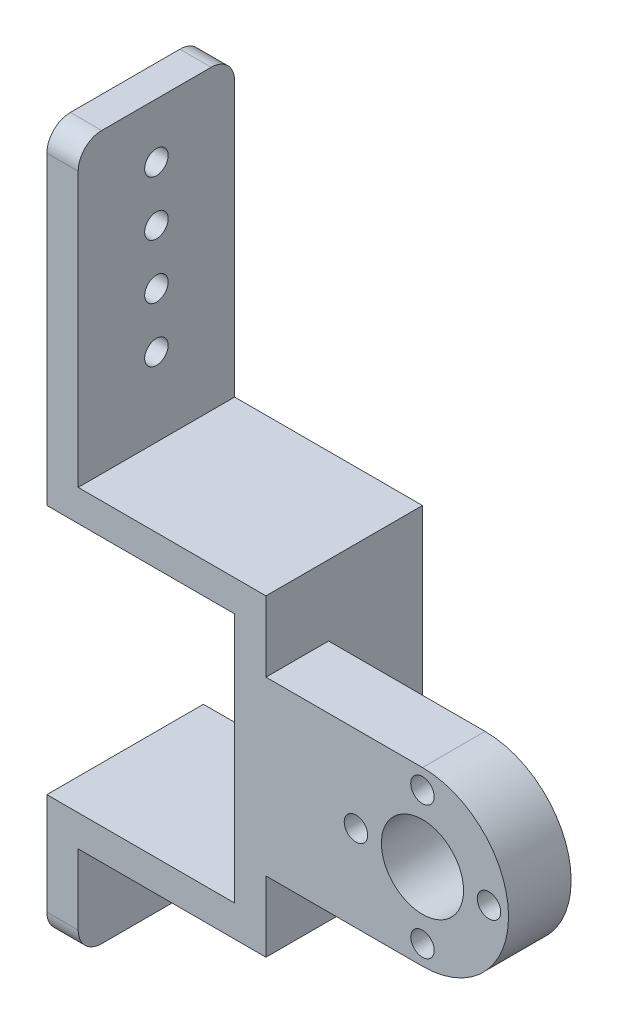
ISO-10303-21;
HEADER;
FILE_DESCRIPTION(('STEP AP214'),'2;1');
FILE_NAME('part.step','',(''),(''),'','','');
FILE_SCHEMA(('AUTOMOTIVE_DESIGN { 1 0 10303 214 1 1 1 1 }'));
ENDSEC;
DATA;
#1=APPLICATION_CONTEXT('core data for automotive mechanical design processes');
#2=APPLICATION_PROTOCOL_DEFINITION('international standard','automotive_design',2000,#1);
#3=PRODUCT_CONTEXT('',#1,'mechanical');
#4=PRODUCT('Part','Part','',(#3));
#5=PRODUCT_RELATED_PRODUCT_CATEGORY('part','',(#4));
#6=PRODUCT_DEFINITION_FORMATION('','',#4);
#7=PRODUCT_DEFINITION_CONTEXT('part definition',#1,'design');
#8=PRODUCT_DEFINITION('design','',#6,#7);
#9=PRODUCT_DEFINITION_SHAPE('','',#8);
#10=(LENGTH_UNIT() NAMED_UNIT(*) SI_UNIT(.MILLI.,.METRE.));
#11=(NAMED_UNIT(*) PLANE_ANGLE_UNIT() SI_UNIT($,.RADIAN.));
#12=(NAMED_UNIT(*) SI_UNIT($,.STERADIAN.) SOLID_ANGLE_UNIT());
#13=UNCERTAINTY_MEASURE_WITH_UNIT(LENGTH_MEASURE(1.E-05),#10,'distance_accuracy_value','');
#14=(GEOMETRIC_REPRESENTATION_CONTEXT(3) GLOBAL_UNCERTAINTY_ASSIGNED_CONTEXT((#13)) GLOBAL_UNIT_ASSIGNED_CONTEXT((#10,
#11,#12)) REPRESENTATION_CONTEXT('',''));
#15=CARTESIAN_POINT('',(0.,0.,0.));
#16=DIRECTION('',(0.,0.,1.));
#17=DIRECTION('',(1.,0.,0.));
#18=AXIS2_PLACEMENT_3D('',#15,#16,#17);
#19=CARTESIAN_POINT('',(-12.,0.,8.));
#20=DIRECTION('',(-1.,0.,0.));
#21=DIRECTION('',(0.,0.,1.));
#22=AXIS2_PLACEMENT_3D('',#19,#20,#21);
#23=PLANE('',#22);
#24=DIRECTION('',(0.,1.,0.));
#25=VECTOR('',#24,1.);
#26=CARTESIAN_POINT('',(-12.,20.,-12.));
#27=LINE('',#26,#25);
#28=CARTESIAN_POINT('',(-12.,-16.,-12.));
#29=VERTEX_POINT('',#28);
#30=CARTESIAN_POINT('',(-12.,16.,-12.));
#31=VERTEX_POINT('',#30);
#32=EDGE_CURVE('E294',#29,#31,#27,.T.);
#33=ORIENTED_EDGE('',*,*,#32,.F.);
#34=DIRECTION('',(0.,0.,-1.));
#35=VECTOR('',#34,1.);
#36=CARTESIAN_POINT('',(-12.,-16.,-12.));
#37=LINE('',#36,#35);
#38=CARTESIAN_POINT('',(-12.,-16.,8.));
#39=VERTEX_POINT('',#38);
#40=EDGE_CURVE('E238',#39,#29,#37,.T.);
#41=ORIENTED_EDGE('',*,*,#40,.F.);
#42=DIRECTION('',(0.,1.,0.));
#43=VECTOR('',#42,1.);
#44=CARTESIAN_POINT('',(-12.,0.,8.));
#45=LINE('',#44,#43);
#46=CARTESIAN_POINT('',(-12.,16.,8.));
#47=VERTEX_POINT('',#46);
#48=EDGE_CURVE('E344',#39,#47,#45,.T.);
#49=ORIENTED_EDGE('',*,*,#48,.T.);
#50=DIRECTION('',(0.,0.,1.));
#51=VECTOR('',#50,1.);
#52=CARTESIAN_POINT('',(-12.,16.,-12.));
#53=LINE('',#52,#51);
#54=EDGE_CURVE('E265',#31,#47,#53,.T.);
#55=ORIENTED_EDGE('',*,*,#54,.F.);
#56=EDGE_LOOP('',(#33,#41,#49,#55));
#57=FACE_BOUND('',#56,.T.);
#58=ADVANCED_FACE('F43',(#57),#23,.T.);
#59=CARTESIAN_POINT('',(0.,0.,0.));
#60=DIRECTION('',(0.,0.,1.));
#61=DIRECTION('',(1.,0.,0.));
#62=AXIS2_PLACEMENT_3D('',#59,#60,#61);
#63=PLANE('',#62);
#64=CARTESIAN_POINT('',(12.,8.5,0.));
#65=DIRECTION('',(0.,0.,-1.));
#66=DIRECTION('',(-1.,0.,0.));
#67=AXIS2_PLACEMENT_3D('',#64,#65,#66);
#68=CIRCLE('',#67,1.5);
#69=CARTESIAN_POINT('',(10.5,8.5,0.));
#70=VERTEX_POINT('',#69);
#71=EDGE_CURVE('E430',#70,#70,#68,.T.);
#72=ORIENTED_EDGE('',*,*,#71,.F.);
#73=EDGE_LOOP('',(#72));
#74=FACE_BOUND('',#73,.T.);
#75=CARTESIAN_POINT('',(20.5,0.,0.));
#76=DIRECTION('',(0.,0.,-1.));
#77=DIRECTION('',(-1.,0.,0.));
#78=AXIS2_PLACEMENT_3D('',#75,#76,#77);
#79=CIRCLE('',#78,1.5);
#80=CARTESIAN_POINT('',(19.,0.,0.));
#81=VERTEX_POINT('',#80);
#82=EDGE_CURVE('E633',#81,#81,#79,.T.);
#83=ORIENTED_EDGE('',*,*,#82,.F.);
#84=EDGE_LOOP('',(#83));
#85=FACE_BOUND('',#84,.T.);
#86=CARTESIAN_POINT('',(12.,-8.5,0.));
#87=DIRECTION('',(0.,0.,-1.));
#88=DIRECTION('',(-1.,0.,0.));
#89=AXIS2_PLACEMENT_3D('',#86,#87,#88);
#90=CIRCLE('',#89,1.5);
#91=CARTESIAN_POINT('',(10.5,-8.5,0.));
#92=VERTEX_POINT('',#91);
#93=EDGE_CURVE('E637',#92,#92,#90,.T.);
#94=ORIENTED_EDGE('',*,*,#93,.F.);
#95=EDGE_LOOP('',(#94));
#96=FACE_BOUND('',#95,.T.);
#97=CARTESIAN_POINT('',(3.5,0.,0.));
#98=DIRECTION('',(0.,0.,-1.));
#99=DIRECTION('',(-1.,0.,0.));
#100=AXIS2_PLACEMENT_3D('',#97,#98,#99);
#101=CIRCLE('',#100,1.5);
#102=CARTESIAN_POINT('',(2.,0.,0.));
#103=VERTEX_POINT('',#102);
#104=EDGE_CURVE('E643',#103,#103,#101,.T.);
#105=ORIENTED_EDGE('',*,*,#104,.F.);
#106=EDGE_LOOP('',(#105));
#107=FACE_BOUND('',#106,.T.);
#108=CARTESIAN_POINT('',(12.,0.,0.));
#109=DIRECTION('',(0.,0.,1.));
#110=DIRECTION('',(1.,0.,0.));
#111=AXIS2_PLACEMENT_3D('',#108,#109,#110);
#112=CIRCLE('',#111,5.25);
#113=CARTESIAN_POINT('',(17.25,0.,0.));
#114=VERTEX_POINT('',#113);
#115=EDGE_CURVE('E328',#114,#114,#112,.T.);
#116=ORIENTED_EDGE('',*,*,#115,.T.);
#117=EDGE_LOOP('',(#116));
#118=FACE_BOUND('',#117,.T.);
#119=DIRECTION('',(0.,-1.,0.));
#120=VECTOR('',#119,1.);
#121=CARTESIAN_POINT('',(-8.,20.,0.));
#122=LINE('',#121,#120);
#123=CARTESIAN_POINT('',(-8.,11.,0.));
#124=VERTEX_POINT('',#123);
#125=CARTESIAN_POINT('',(-7.99999999999999,-11.,0.));
#126=VERTEX_POINT('',#125);
#127=EDGE_CURVE('E301',#124,#126,#122,.T.);
#128=ORIENTED_EDGE('',*,*,#127,.F.);
#129=DIRECTION('',(1.,0.,0.));
#130=VECTOR('',#129,1.);
#131=CARTESIAN_POINT('',(0.,11.,0.));
#132=LINE('',#131,#130);
#133=CARTESIAN_POINT('',(12.,11.,0.));
#134=VERTEX_POINT('',#133);
#135=EDGE_CURVE('E354',#124,#134,#132,.T.);
#136=ORIENTED_EDGE('',*,*,#135,.T.);
#137=CARTESIAN_POINT('',(12.,0.,0.));
#138=DIRECTION('',(0.,0.,1.));
#139=DIRECTION('',(1.,0.,0.));
#140=AXIS2_PLACEMENT_3D('',#137,#138,#139);
#141=CIRCLE('',#140,11.);
#142=CARTESIAN_POINT('',(12.,-11.,0.));
#143=VERTEX_POINT('',#142);
#144=EDGE_CURVE('E332',#143,#134,#141,.T.);
#145=ORIENTED_EDGE('',*,*,#144,.F.);
#146=DIRECTION('',(1.,0.,0.));
#147=VECTOR('',#146,1.);
#148=CARTESIAN_POINT('',(0.,-11.,0.));
#149=LINE('',#148,#147);
#150=EDGE_CURVE('E341',#126,#143,#149,.T.);
#151=ORIENTED_EDGE('',*,*,#150,.F.);
#152=EDGE_LOOP('',(#128,#136,#145,#151));
#153=FACE_BOUND('',#152,.T.);
#154=ADVANCED_FACE('F503',(#74,#85,#96,#107,#118,#153),#63,.F.);
#155=CARTESIAN_POINT('',(12.,0.,8.));
#156=DIRECTION('',(0.,0.,-1.));
#157=DIRECTION('',(-1.,0.,0.));
#158=AXIS2_PLACEMENT_3D('',#155,#156,#157);
#159=CYLINDRICAL_SURFACE('',#158,11.);
#160=ORIENTED_EDGE('',*,*,#144,.T.);
#161=DIRECTION('',(0.,0.,-1.));
#162=VECTOR('',#161,1.);
#163=CARTESIAN_POINT('',(12.,11.,8.));
#164=LINE('',#163,#162);
#165=CARTESIAN_POINT('',(12.,11.,8.));
#166=VERTEX_POINT('',#165);
#167=EDGE_CURVE('E305',#166,#134,#164,.T.);
#168=ORIENTED_EDGE('',*,*,#167,.F.);
#169=CARTESIAN_POINT('',(12.,0.,8.));
#170=DIRECTION('',(0.,0.,1.));
#171=DIRECTION('',(1.,0.,0.));
#172=AXIS2_PLACEMENT_3D('',#169,#170,#171);
#173=CIRCLE('',#172,11.);
#174=CARTESIAN_POINT('',(12.,-11.,8.));
#175=VERTEX_POINT('',#174);
#176=EDGE_CURVE('E336',#175,#166,#173,.T.);
#177=ORIENTED_EDGE('',*,*,#176,.F.);
#178=DIRECTION('',(0.,0.,-1.));
#179=VECTOR('',#178,1.);
#180=CARTESIAN_POINT('',(12.,-11.,8.));
#181=LINE('',#180,#179);
#182=EDGE_CURVE('E350',#175,#143,#181,.T.);
#183=ORIENTED_EDGE('',*,*,#182,.T.);
#184=EDGE_LOOP('',(#160,#168,#177,#183));
#185=FACE_BOUND('',#184,.T.);
#186=ADVANCED_FACE('F497',(#185),#159,.T.);
#187=CARTESIAN_POINT('',(0.,11.,8.));
#188=DIRECTION('',(0.,1.,0.));
#189=DIRECTION('',(0.,0.,1.));
#190=AXIS2_PLACEMENT_3D('',#187,#188,#189);
#191=PLANE('',#190);
#192=DIRECTION('',(0.,0.,1.));
#193=VECTOR('',#192,1.);
#194=CARTESIAN_POINT('',(-8.,11.,0.));
#195=LINE('',#194,#193);
#196=CARTESIAN_POINT('',(-8.,11.,8.));
#197=VERTEX_POINT('',#196);
#198=EDGE_CURVE('E320',#124,#197,#195,.T.);
#199=ORIENTED_EDGE('',*,*,#198,.T.);
#200=DIRECTION('',(1.,0.,0.));
#201=VECTOR('',#200,1.);
#202=CARTESIAN_POINT('',(0.,11.,8.));
#203=LINE('',#202,#201);
#204=EDGE_CURVE('E340',#197,#166,#203,.T.);
#205=ORIENTED_EDGE('',*,*,#204,.T.);
#206=ORIENTED_EDGE('',*,*,#167,.T.);
#207=ORIENTED_EDGE('',*,*,#135,.F.);
#208=EDGE_LOOP('',(#199,#205,#206,#207));
#209=FACE_BOUND('',#208,.T.);
#210=ADVANCED_FACE('F500',(#209),#191,.T.);
#211=CARTESIAN_POINT('',(0.,-11.,8.));
#212=DIRECTION('',(0.,1.,0.));
#213=DIRECTION('',(0.,0.,1.));
#214=AXIS2_PLACEMENT_3D('',#211,#212,#213);
#215=PLANE('',#214);
#216=DIRECTION('',(1.,0.,0.));
#217=VECTOR('',#216,1.);
#218=CARTESIAN_POINT('',(0.,-11.,8.));
#219=LINE('',#218,#217);
#220=CARTESIAN_POINT('',(-7.99999999999999,-11.,8.));
#221=VERTEX_POINT('',#220);
#222=EDGE_CURVE('E347',#221,#175,#219,.T.);
#223=ORIENTED_EDGE('',*,*,#222,.F.);
#224=DIRECTION('',(0.,0.,1.));
#225=VECTOR('',#224,1.);
#226=CARTESIAN_POINT('',(-7.99999999999999,-11.,0.));
#227=LINE('',#226,#225);
#228=EDGE_CURVE('E300',#126,#221,#227,.T.);
#229=ORIENTED_EDGE('',*,*,#228,.F.);
#230=ORIENTED_EDGE('',*,*,#150,.T.);
#231=ORIENTED_EDGE('',*,*,#182,.F.);
#232=EDGE_LOOP('',(#223,#229,#230,#231));
#233=FACE_BOUND('',#232,.T.);
#234=ADVANCED_FACE('F493',(#233),#215,.F.);
#235=CARTESIAN_POINT('',(0.,0.,8.));
#236=DIRECTION('',(0.,0.,1.));
#237=DIRECTION('',(1.,0.,0.));
#238=AXIS2_PLACEMENT_3D('',#235,#236,#237);
#239=PLANE('',#238);
#240=CARTESIAN_POINT('',(12.,8.5,8.));
#241=DIRECTION('',(0.,0.,1.));
#242=DIRECTION('',(1.,0.,0.));
#243=AXIS2_PLACEMENT_3D('',#240,#241,#242);
#244=CIRCLE('',#243,1.5);
#245=CARTESIAN_POINT('',(13.5,8.5,8.));
#246=VERTEX_POINT('',#245);
#247=EDGE_CURVE('E47',#246,#246,#244,.T.);
#248=ORIENTED_EDGE('',*,*,#247,.F.);
#249=EDGE_LOOP('',(#248));
#250=FACE_BOUND('',#249,.T.);
#251=CARTESIAN_POINT('',(20.5,0.,8.));
#252=DIRECTION('',(0.,0.,1.));
#253=DIRECTION('',(1.,0.,0.));
#254=AXIS2_PLACEMENT_3D('',#251,#252,#253);
#255=CIRCLE('',#254,1.5);
#256=CARTESIAN_POINT('',(22.,0.,8.));
#257=VERTEX_POINT('',#256);
#258=EDGE_CURVE('E433',#257,#257,#255,.T.);
#259=ORIENTED_EDGE('',*,*,#258,.F.);
#260=EDGE_LOOP('',(#259));
#261=FACE_BOUND('',#260,.T.);
#262=CARTESIAN_POINT('',(12.,-8.5,8.));
#263=DIRECTION('',(0.,0.,1.));
#264=DIRECTION('',(1.,0.,0.));
#265=AXIS2_PLACEMENT_3D('',#262,#263,#264);
#266=CIRCLE('',#265,1.5);
#267=CARTESIAN_POINT('',(13.5,-8.5,8.));
#268=VERTEX_POINT('',#267);
#269=EDGE_CURVE('E429',#268,#268,#266,.T.);
#270=ORIENTED_EDGE('',*,*,#269,.F.);
#271=EDGE_LOOP('',(#270));
#272=FACE_BOUND('',#271,.T.);
#273=CARTESIAN_POINT('',(3.5,0.,8.));
#274=DIRECTION('',(0.,0.,1.));
#275=DIRECTION('',(1.,0.,0.));
#276=AXIS2_PLACEMENT_3D('',#273,#274,#275);
#277=CIRCLE('',#276,1.5);
#278=CARTESIAN_POINT('',(5.,0.,8.));
#279=VERTEX_POINT('',#278);
#280=EDGE_CURVE('E425',#279,#279,#277,.T.);
#281=ORIENTED_EDGE('',*,*,#280,.F.);
#282=EDGE_LOOP('',(#281));
#283=FACE_BOUND('',#282,.T.);
#284=CARTESIAN_POINT('',(12.,0.,8.));
#285=DIRECTION('',(0.,0.,1.));
#286=DIRECTION('',(1.,0.,0.));
#287=AXIS2_PLACEMENT_3D('',#284,#285,#286);
#288=CIRCLE('',#287,5.25);
#289=CARTESIAN_POINT('',(17.25,0.,8.));
#290=VERTEX_POINT('',#289);
#291=EDGE_CURVE('E324',#290,#290,#288,.T.);
#292=ORIENTED_EDGE('',*,*,#291,.F.);
#293=EDGE_LOOP('',(#292));
#294=FACE_BOUND('',#293,.T.);
#295=DIRECTION('',(0.,-1.,0.));
#296=VECTOR('',#295,1.);
#297=CARTESIAN_POINT('',(-32.,20.,8.));
#298=LINE('',#297,#296);
#299=CARTESIAN_POINT('',(-32.,55.,8.));
#300=VERTEX_POINT('',#299);
#301=CARTESIAN_POINT('',(-32.,20.,8.));
#302=VERTEX_POINT('',#301);
#303=EDGE_CURVE('E228',#300,#302,#298,.T.);
#304=ORIENTED_EDGE('',*,*,#303,.F.);
#305=DIRECTION('',(1.,0.,0.));
#306=VECTOR('',#305,1.);
#307=CARTESIAN_POINT('',(0.,55.,8.));
#308=LINE('',#307,#306);
#309=CARTESIAN_POINT('',(-36.,55.,8.));
#310=VERTEX_POINT('',#309);
#311=EDGE_CURVE('E396',#300,#310,#308,.F.);
#312=ORIENTED_EDGE('',*,*,#311,.T.);
#313=DIRECTION('',(0.,1.,0.));
#314=VECTOR('',#313,1.);
#315=CARTESIAN_POINT('',(-36.,20.,8.));
#316=LINE('',#315,#314);
#317=CARTESIAN_POINT('',(-36.,16.,8.));
#318=VERTEX_POINT('',#317);
#319=EDGE_CURVE('E272',#318,#310,#316,.T.);
#320=ORIENTED_EDGE('',*,*,#319,.F.);
#321=DIRECTION('',(1.,0.,0.));
#322=VECTOR('',#321,1.);
#323=CARTESIAN_POINT('',(-36.,16.,8.));
#324=LINE('',#323,#322);
#325=EDGE_CURVE('E276',#318,#47,#324,.T.);
#326=ORIENTED_EDGE('',*,*,#325,.T.);
#327=ORIENTED_EDGE('',*,*,#48,.F.);
#328=DIRECTION('',(1.,0.,0.));
#329=VECTOR('',#328,1.);
#330=CARTESIAN_POINT('',(-36.,-16.,8.));
#331=LINE('',#330,#329);
#332=CARTESIAN_POINT('',(-36.,-16.,8.));
#333=VERTEX_POINT('',#332);
#334=EDGE_CURVE('E262',#333,#39,#331,.T.);
#335=ORIENTED_EDGE('',*,*,#334,.F.);
#336=DIRECTION('',(0.,1.,0.));
#337=VECTOR('',#336,1.);
#338=CARTESIAN_POINT('',(-36.,-20.,8.));
#339=LINE('',#338,#337);
#340=CARTESIAN_POINT('',(-36.,-29.,8.));
#341=VERTEX_POINT('',#340);
#342=EDGE_CURVE('E250',#341,#333,#339,.T.);
#343=ORIENTED_EDGE('',*,*,#342,.F.);
#344=DIRECTION('',(-1.,0.,0.));
#345=VECTOR('',#344,1.);
#346=CARTESIAN_POINT('',(0.,-29.,8.));
#347=LINE('',#346,#345);
#348=CARTESIAN_POINT('',(-32.,-29.,8.));
#349=VERTEX_POINT('',#348);
#350=EDGE_CURVE('E192',#341,#349,#347,.F.);
#351=ORIENTED_EDGE('',*,*,#350,.T.);
#352=DIRECTION('',(0.,1.,0.));
#353=VECTOR('',#352,1.);
#354=CARTESIAN_POINT('',(-32.,-32.,8.));
#355=LINE('',#354,#353);
#356=CARTESIAN_POINT('',(-32.,-20.,8.));
#357=VERTEX_POINT('',#356);
#358=EDGE_CURVE('E183',#349,#357,#355,.T.);
#359=ORIENTED_EDGE('',*,*,#358,.T.);
#360=DIRECTION('',(1.,0.,0.));
#361=VECTOR('',#360,1.);
#362=CARTESIAN_POINT('',(-12.,-20.,8.));
#363=LINE('',#362,#361);
#364=CARTESIAN_POINT('',(-7.99999999999999,-20.,8.));
#365=VERTEX_POINT('',#364);
#366=EDGE_CURVE('E188',#357,#365,#363,.T.);
#367=ORIENTED_EDGE('',*,*,#366,.T.);
#368=DIRECTION('',(0.,1.,0.));
#369=VECTOR('',#368,1.);
#370=CARTESIAN_POINT('',(-7.99999999999999,-20.,8.));
#371=LINE('',#370,#369);
#372=EDGE_CURVE('E208',#365,#221,#371,.T.);
#373=ORIENTED_EDGE('',*,*,#372,.T.);
#374=ORIENTED_EDGE('',*,*,#222,.T.);
#375=ORIENTED_EDGE('',*,*,#176,.T.);
#376=ORIENTED_EDGE('',*,*,#204,.F.);
#377=DIRECTION('',(0.,1.,0.));
#378=VECTOR('',#377,1.);
#379=CARTESIAN_POINT('',(-8.,20.,8.));
#380=LINE('',#379,#378);
#381=CARTESIAN_POINT('',(-8.,20.,8.));
#382=VERTEX_POINT('',#381);
#383=EDGE_CURVE('E207',#197,#382,#380,.T.);
#384=ORIENTED_EDGE('',*,*,#383,.T.);
#385=DIRECTION('',(-1.,0.,0.));
#386=VECTOR('',#385,1.);
#387=CARTESIAN_POINT('',(-12.,20.,8.));
#388=LINE('',#387,#386);
#389=EDGE_CURVE('E316',#382,#302,#388,.T.);
#390=ORIENTED_EDGE('',*,*,#389,.T.);
#391=EDGE_LOOP('',(#304,#312,#320,#326,#327,#335,#343,#351,#359,#367,#373,#374,#375,#376,#384,#390));
#392=FACE_BOUND('',#391,.T.);
#393=ADVANCED_FACE('F186',(#250,#261,#272,#283,#294,#392),#239,.T.);
#394=CARTESIAN_POINT('',(12.,0.,0.));
#395=DIRECTION('',(0.,0.,1.));
#396=DIRECTION('',(1.,0.,0.));
#397=AXIS2_PLACEMENT_3D('',#394,#395,#396);
#398=CYLINDRICAL_SURFACE('',#397,5.25);
#399=ORIENTED_EDGE('',*,*,#115,.F.);
#400=EDGE_LOOP('',(#399));
#401=FACE_BOUND('',#400,.T.);
#402=ORIENTED_EDGE('',*,*,#291,.T.);
#403=EDGE_LOOP('',(#402));
#404=FACE_BOUND('',#403,.T.);
#405=ADVANCED_FACE('F573',(#401,#404),#398,.F.);
#406=CARTESIAN_POINT('',(-12.,20.,0.));
#407=DIRECTION('',(0.,1.,0.));
#408=DIRECTION('',(0.,0.,1.));
#409=AXIS2_PLACEMENT_3D('',#406,#407,#408);
#410=PLANE('',#409);
#411=DIRECTION('',(0.,0.,-1.));
#412=VECTOR('',#411,1.);
#413=CARTESIAN_POINT('',(-32.,20.,8.));
#414=LINE('',#413,#412);
#415=CARTESIAN_POINT('',(-32.,20.,-12.));
#416=VERTEX_POINT('',#415);
#417=EDGE_CURVE('E239',#302,#416,#414,.T.);
#418=ORIENTED_EDGE('',*,*,#417,.F.);
#419=ORIENTED_EDGE('',*,*,#389,.F.);
#420=DIRECTION('',(0.,0.,1.));
#421=VECTOR('',#420,1.);
#422=CARTESIAN_POINT('',(-8.,20.,0.));
#423=LINE('',#422,#421);
#424=CARTESIAN_POINT('',(-8.,20.,-12.));
#425=VERTEX_POINT('',#424);
#426=EDGE_CURVE('E321',#425,#382,#423,.T.);
#427=ORIENTED_EDGE('',*,*,#426,.F.);
#428=DIRECTION('',(1.,0.,0.));
#429=VECTOR('',#428,1.);
#430=CARTESIAN_POINT('',(-8.,20.,-12.));
#431=LINE('',#430,#429);
#432=EDGE_CURVE('E297',#416,#425,#431,.T.);
#433=ORIENTED_EDGE('',*,*,#432,.F.);
#434=EDGE_LOOP('',(#418,#419,#427,#433));
#435=FACE_BOUND('',#434,.T.);
#436=ADVANCED_FACE('F571',(#435),#410,.T.);
#437=CARTESIAN_POINT('',(-8.,20.,0.));
#438=DIRECTION('',(1.,0.,0.));
#439=DIRECTION('',(0.,0.,-1.));
#440=AXIS2_PLACEMENT_3D('',#437,#438,#439);
#441=PLANE('',#440);
#442=ORIENTED_EDGE('',*,*,#383,.F.);
#443=ORIENTED_EDGE('',*,*,#198,.F.);
#444=ORIENTED_EDGE('',*,*,#127,.T.);
#445=ORIENTED_EDGE('',*,*,#228,.T.);
#446=ORIENTED_EDGE('',*,*,#372,.F.);
#447=DIRECTION('',(0.,0.,1.));
#448=VECTOR('',#447,1.);
#449=CARTESIAN_POINT('',(-7.99999999999999,-20.,0.));
#450=LINE('',#449,#448);
#451=CARTESIAN_POINT('',(-8.,-20.,-12.));
#452=VERTEX_POINT('',#451);
#453=EDGE_CURVE('E204',#452,#365,#450,.T.);
#454=ORIENTED_EDGE('',*,*,#453,.F.);
#455=DIRECTION('',(0.,-1.,0.));
#456=VECTOR('',#455,1.);
#457=CARTESIAN_POINT('',(-8.,20.,-12.));
#458=LINE('',#457,#456);
#459=EDGE_CURVE('E287',#425,#452,#458,.T.);
#460=ORIENTED_EDGE('',*,*,#459,.F.);
#461=ORIENTED_EDGE('',*,*,#426,.T.);
#462=EDGE_LOOP('',(#442,#443,#444,#445,#446,#454,#460,#461));
#463=FACE_BOUND('',#462,.T.);
#464=ADVANCED_FACE('F485',(#463),#441,.T.);
#465=CARTESIAN_POINT('',(-12.,-20.,0.));
#466=DIRECTION('',(0.,-1.,0.));
#467=DIRECTION('',(0.,0.,-1.));
#468=AXIS2_PLACEMENT_3D('',#465,#466,#467);
#469=PLANE('',#468);
#470=DIRECTION('',(0.,0.,1.));
#471=VECTOR('',#470,1.);
#472=CARTESIAN_POINT('',(-32.,-20.,8.));
#473=LINE('',#472,#471);
#474=CARTESIAN_POINT('',(-32.,-20.,-12.));
#475=VERTEX_POINT('',#474);
#476=EDGE_CURVE('E202',#475,#357,#473,.T.);
#477=ORIENTED_EDGE('',*,*,#476,.F.);
#478=DIRECTION('',(-1.,0.,0.));
#479=VECTOR('',#478,1.);
#480=CARTESIAN_POINT('',(-8.,-20.,-12.));
#481=LINE('',#480,#479);
#482=EDGE_CURVE('E291',#452,#475,#481,.T.);
#483=ORIENTED_EDGE('',*,*,#482,.F.);
#484=ORIENTED_EDGE('',*,*,#453,.T.);
#485=ORIENTED_EDGE('',*,*,#366,.F.);
#486=EDGE_LOOP('',(#477,#483,#484,#485));
#487=FACE_BOUND('',#486,.T.);
#488=ADVANCED_FACE('F200',(#487),#469,.T.);
#489=CARTESIAN_POINT('',(0.,0.,-12.));
#490=DIRECTION('',(0.,0.,-1.));
#491=DIRECTION('',(-1.,0.,0.));
#492=AXIS2_PLACEMENT_3D('',#489,#490,#491);
#493=PLANE('',#492);
#494=DIRECTION('',(0.,-1.,0.));
#495=VECTOR('',#494,1.);
#496=CARTESIAN_POINT('',(-36.,20.,-12.));
#497=LINE('',#496,#495);
#498=CARTESIAN_POINT('',(-36.,55.,-12.));
#499=VERTEX_POINT('',#498);
#500=CARTESIAN_POINT('',(-36.,16.,-12.));
#501=VERTEX_POINT('',#500);
#502=EDGE_CURVE('E266',#499,#501,#497,.T.);
#503=ORIENTED_EDGE('',*,*,#502,.F.);
#504=DIRECTION('',(1.,0.,0.));
#505=VECTOR('',#504,1.);
#506=CARTESIAN_POINT('',(0.,55.,-12.));
#507=LINE('',#506,#505);
#508=CARTESIAN_POINT('',(-32.,55.,-12.));
#509=VERTEX_POINT('',#508);
#510=EDGE_CURVE('E408',#499,#509,#507,.T.);
#511=ORIENTED_EDGE('',*,*,#510,.T.);
#512=DIRECTION('',(0.,-1.,0.));
#513=VECTOR('',#512,1.);
#514=CARTESIAN_POINT('',(-32.,20.,-12.));
#515=LINE('',#514,#513);
#516=EDGE_CURVE('E227',#509,#416,#515,.T.);
#517=ORIENTED_EDGE('',*,*,#516,.T.);
#518=ORIENTED_EDGE('',*,*,#432,.T.);
#519=ORIENTED_EDGE('',*,*,#459,.T.);
#520=ORIENTED_EDGE('',*,*,#482,.T.);
#521=DIRECTION('',(0.,1.,0.));
#522=VECTOR('',#521,1.);
#523=CARTESIAN_POINT('',(-32.,-32.,-12.));
#524=LINE('',#523,#522);
#525=CARTESIAN_POINT('',(-32.,-29.,-12.));
#526=VERTEX_POINT('',#525);
#527=EDGE_CURVE('E195',#526,#475,#524,.T.);
#528=ORIENTED_EDGE('',*,*,#527,.F.);
#529=DIRECTION('',(1.,0.,0.));
#530=VECTOR('',#529,1.);
#531=CARTESIAN_POINT('',(0.,-29.,-12.));
#532=LINE('',#531,#530);
#533=CARTESIAN_POINT('',(-36.,-29.,-12.));
#534=VERTEX_POINT('',#533);
#535=EDGE_CURVE('E405',#526,#534,#532,.F.);
#536=ORIENTED_EDGE('',*,*,#535,.T.);
#537=DIRECTION('',(0.,-1.,0.));
#538=VECTOR('',#537,1.);
#539=CARTESIAN_POINT('',(-36.,-20.,-12.));
#540=LINE('',#539,#538);
#541=CARTESIAN_POINT('',(-36.,-16.,-12.));
#542=VERTEX_POINT('',#541);
#543=EDGE_CURVE('E246',#542,#534,#540,.T.);
#544=ORIENTED_EDGE('',*,*,#543,.F.);
#545=DIRECTION('',(1.,0.,0.));
#546=VECTOR('',#545,1.);
#547=CARTESIAN_POINT('',(-36.,-16.,-12.));
#548=LINE('',#547,#546);
#549=EDGE_CURVE('E256',#542,#29,#548,.T.);
#550=ORIENTED_EDGE('',*,*,#549,.T.);
#551=ORIENTED_EDGE('',*,*,#32,.T.);
#552=DIRECTION('',(1.,0.,0.));
#553=VECTOR('',#552,1.);
#554=CARTESIAN_POINT('',(-36.,16.,-12.));
#555=LINE('',#554,#553);
#556=EDGE_CURVE('E283',#501,#31,#555,.T.);
#557=ORIENTED_EDGE('',*,*,#556,.F.);
#558=EDGE_LOOP('',(#503,#511,#517,#518,#519,#520,#528,#536,#544,#550,#551,#557));
#559=FACE_BOUND('',#558,.T.);
#560=ADVANCED_FACE('F480',(#559),#493,.T.);
#561=CARTESIAN_POINT('',(-36.,16.,-12.));
#562=DIRECTION('',(0.,1.,0.));
#563=DIRECTION('',(0.,0.,1.));
#564=AXIS2_PLACEMENT_3D('',#561,#562,#563);
#565=PLANE('',#564);
#566=ORIENTED_EDGE('',*,*,#54,.T.);
#567=ORIENTED_EDGE('',*,*,#325,.F.);
#568=DIRECTION('',(0.,0.,1.));
#569=VECTOR('',#568,1.);
#570=CARTESIAN_POINT('',(-36.,16.,-12.));
#571=LINE('',#570,#569);
#572=EDGE_CURVE('E269',#501,#318,#571,.T.);
#573=ORIENTED_EDGE('',*,*,#572,.F.);
#574=ORIENTED_EDGE('',*,*,#556,.T.);
#575=EDGE_LOOP('',(#566,#567,#573,#574));
#576=FACE_BOUND('',#575,.T.);
#577=ADVANCED_FACE('F553',(#576),#565,.F.);
#578=CARTESIAN_POINT('',(-36.,0.,0.));
#579=DIRECTION('',(-1.,0.,0.));
#580=DIRECTION('',(0.,0.,1.));
#581=AXIS2_PLACEMENT_3D('',#578,#579,#580);
#582=PLANE('',#581);
#583=CARTESIAN_POINT('',(-36.,51.,-2.));
#584=DIRECTION('',(-1.,0.,0.));
#585=DIRECTION('',(0.,0.,1.));
#586=AXIS2_PLACEMENT_3D('',#583,#584,#585);
#587=CIRCLE('',#586,1.5);
#588=CARTESIAN_POINT('',(-36.,51.,-0.499999999999999));
#589=VERTEX_POINT('',#588);
#590=EDGE_CURVE('E370',#589,#589,#587,.T.);
#591=ORIENTED_EDGE('',*,*,#590,.F.);
#592=EDGE_LOOP('',(#591));
#593=FACE_BOUND('',#592,.T.);
#594=CARTESIAN_POINT('',(-36.,44.,-2.));
#595=DIRECTION('',(-1.,0.,0.));
#596=DIRECTION('',(0.,0.,1.));
#597=AXIS2_PLACEMENT_3D('',#594,#595,#596);
#598=CIRCLE('',#597,1.5);
#599=CARTESIAN_POINT('',(-36.,44.,-0.499999999999999));
#600=VERTEX_POINT('',#599);
#601=EDGE_CURVE('E451',#600,#600,#598,.T.);
#602=ORIENTED_EDGE('',*,*,#601,.F.);
#603=EDGE_LOOP('',(#602));
#604=FACE_BOUND('',#603,.T.);
#605=CARTESIAN_POINT('',(-36.,37.,-2.));
#606=DIRECTION('',(-1.,0.,0.));
#607=DIRECTION('',(0.,0.,1.));
#608=AXIS2_PLACEMENT_3D('',#605,#606,#607);
#609=CIRCLE('',#608,1.5);
#610=CARTESIAN_POINT('',(-36.,37.,-0.499999999999999));
#611=VERTEX_POINT('',#610);
#612=EDGE_CURVE('E445',#611,#611,#609,.T.);
#613=ORIENTED_EDGE('',*,*,#612,.F.);
#614=EDGE_LOOP('',(#613));
#615=FACE_BOUND('',#614,.T.);
#616=CARTESIAN_POINT('',(-36.,30.,-2.));
#617=DIRECTION('',(-1.,0.,0.));
#618=DIRECTION('',(0.,0.,1.));
#619=AXIS2_PLACEMENT_3D('',#616,#617,#618);
#620=CIRCLE('',#619,1.5);
#621=CARTESIAN_POINT('',(-36.,30.,-0.499999999999999));
#622=VERTEX_POINT('',#621);
#623=EDGE_CURVE('E440',#622,#622,#620,.T.);
#624=ORIENTED_EDGE('',*,*,#623,.F.);
#625=EDGE_LOOP('',(#624));
#626=FACE_BOUND('',#625,.T.);
#627=ORIENTED_EDGE('',*,*,#319,.T.);
#628=CARTESIAN_POINT('',(-36.,55.,5.));
#629=DIRECTION('',(-1.,0.,0.));
#630=DIRECTION('',(0.,0.,1.));
#631=AXIS2_PLACEMENT_3D('',#628,#629,#630);
#632=CIRCLE('',#631,3.);
#633=CARTESIAN_POINT('',(-36.,58.,5.));
#634=VERTEX_POINT('',#633);
#635=EDGE_CURVE('E402',#310,#634,#632,.T.);
#636=ORIENTED_EDGE('',*,*,#635,.T.);
#637=DIRECTION('',(0.,0.,-1.));
#638=VECTOR('',#637,1.);
#639=CARTESIAN_POINT('',(-36.,58.,8.));
#640=LINE('',#639,#638);
#641=CARTESIAN_POINT('',(-36.,58.,-9.));
#642=VERTEX_POINT('',#641);
#643=EDGE_CURVE('E234',#634,#642,#640,.T.);
#644=ORIENTED_EDGE('',*,*,#643,.T.);
#645=CARTESIAN_POINT('',(-36.,55.,-9.));
#646=DIRECTION('',(-1.,0.,0.));
#647=DIRECTION('',(0.,0.,1.));
#648=AXIS2_PLACEMENT_3D('',#645,#646,#647);
#649=CIRCLE('',#648,3.);
#650=EDGE_CURVE('E399',#642,#499,#649,.T.);
#651=ORIENTED_EDGE('',*,*,#650,.T.);
#652=ORIENTED_EDGE('',*,*,#502,.T.);
#653=ORIENTED_EDGE('',*,*,#572,.T.);
#654=EDGE_LOOP('',(#627,#636,#644,#651,#652,#653));
#655=FACE_BOUND('',#654,.T.);
#656=ADVANCED_FACE('F556',(#593,#604,#615,#626,#655),#582,.T.);
#657=CARTESIAN_POINT('',(-36.,-16.,-12.));
#658=DIRECTION('',(0.,-1.,0.));
#659=DIRECTION('',(0.,0.,-1.));
#660=AXIS2_PLACEMENT_3D('',#657,#658,#659);
#661=PLANE('',#660);
#662=ORIENTED_EDGE('',*,*,#40,.T.);
#663=ORIENTED_EDGE('',*,*,#549,.F.);
#664=DIRECTION('',(0.,0.,-1.));
#665=VECTOR('',#664,1.);
#666=CARTESIAN_POINT('',(-36.,-16.,-12.));
#667=LINE('',#666,#665);
#668=EDGE_CURVE('E253',#333,#542,#667,.T.);
#669=ORIENTED_EDGE('',*,*,#668,.F.);
#670=ORIENTED_EDGE('',*,*,#334,.T.);
#671=EDGE_LOOP('',(#662,#663,#669,#670));
#672=FACE_BOUND('',#671,.T.);
#673=ADVANCED_FACE('F466',(#672),#661,.F.);
#674=CARTESIAN_POINT('',(-36.,0.,0.));
#675=DIRECTION('',(1.,0.,0.));
#676=DIRECTION('',(0.,0.,-1.));
#677=AXIS2_PLACEMENT_3D('',#674,#675,#676);
#678=PLANE('',#677);
#679=CARTESIAN_POINT('',(-36.,-27.5,-2.));
#680=DIRECTION('',(-1.,0.,0.));
#681=DIRECTION('',(0.,0.,1.));
#682=AXIS2_PLACEMENT_3D('',#679,#680,#681);
#683=CIRCLE('',#682,1.5);
#684=CARTESIAN_POINT('',(-36.,-27.5,-0.499999999999999));
#685=VERTEX_POINT('',#684);
#686=EDGE_CURVE('E221',#685,#685,#683,.T.);
#687=ORIENTED_EDGE('',*,*,#686,.F.);
#688=EDGE_LOOP('',(#687));
#689=FACE_BOUND('',#688,.T.);
#690=ORIENTED_EDGE('',*,*,#543,.T.);
#691=CARTESIAN_POINT('',(-36.,-29.,-9.));
#692=DIRECTION('',(1.,0.,0.));
#693=DIRECTION('',(0.,0.,-1.));
#694=AXIS2_PLACEMENT_3D('',#691,#692,#693);
#695=CIRCLE('',#694,3.);
#696=CARTESIAN_POINT('',(-36.,-32.,-9.));
#697=VERTEX_POINT('',#696);
#698=EDGE_CURVE('E11',#534,#697,#695,.F.);
#699=ORIENTED_EDGE('',*,*,#698,.T.);
#700=DIRECTION('',(0.,0.,-1.));
#701=VECTOR('',#700,1.);
#702=CARTESIAN_POINT('',(-36.,-32.,8.));
#703=LINE('',#702,#701);
#704=CARTESIAN_POINT('',(-36.,-32.,5.));
#705=VERTEX_POINT('',#704);
#706=EDGE_CURVE('E213',#705,#697,#703,.T.);
#707=ORIENTED_EDGE('',*,*,#706,.F.);
#708=CARTESIAN_POINT('',(-36.,-29.,5.));
#709=DIRECTION('',(1.,0.,0.));
#710=DIRECTION('',(0.,0.,-1.));
#711=AXIS2_PLACEMENT_3D('',#708,#709,#710);
#712=CIRCLE('',#711,3.);
#713=EDGE_CURVE('E53',#705,#341,#712,.F.);
#714=ORIENTED_EDGE('',*,*,#713,.T.);
#715=ORIENTED_EDGE('',*,*,#342,.T.);
#716=ORIENTED_EDGE('',*,*,#668,.T.);
#717=EDGE_LOOP('',(#690,#699,#707,#714,#715,#716));
#718=FACE_BOUND('',#717,.T.);
#719=ADVANCED_FACE('F462',(#689,#718),#678,.F.);
#720=CARTESIAN_POINT('',(-36.,58.,8.));
#721=DIRECTION('',(0.,1.,0.));
#722=DIRECTION('',(0.,0.,1.));
#723=AXIS2_PLACEMENT_3D('',#720,#721,#722);
#724=PLANE('',#723);
#725=ORIENTED_EDGE('',*,*,#643,.F.);
#726=DIRECTION('',(1.,0.,0.));
#727=VECTOR('',#726,1.);
#728=CARTESIAN_POINT('',(-36.,58.,5.));
#729=LINE('',#728,#727);
#730=CARTESIAN_POINT('',(-32.,58.,5.));
#731=VERTEX_POINT('',#730);
#732=EDGE_CURVE('E384',#634,#731,#729,.T.);
#733=ORIENTED_EDGE('',*,*,#732,.T.);
#734=DIRECTION('',(0.,0.,-1.));
#735=VECTOR('',#734,1.);
#736=CARTESIAN_POINT('',(-32.,58.,8.));
#737=LINE('',#736,#735);
#738=CARTESIAN_POINT('',(-32.,58.,-9.));
#739=VERTEX_POINT('',#738);
#740=EDGE_CURVE('E231',#731,#739,#737,.T.);
#741=ORIENTED_EDGE('',*,*,#740,.T.);
#742=DIRECTION('',(1.,0.,0.));
#743=VECTOR('',#742,1.);
#744=CARTESIAN_POINT('',(-36.,58.,-9.));
#745=LINE('',#744,#743);
#746=EDGE_CURVE('E304',#739,#642,#745,.F.);
#747=ORIENTED_EDGE('',*,*,#746,.T.);
#748=EDGE_LOOP('',(#725,#733,#741,#747));
#749=FACE_BOUND('',#748,.T.);
#750=ADVANCED_FACE('F465',(#749),#724,.T.);
#751=CARTESIAN_POINT('',(-32.,20.,8.));
#752=DIRECTION('',(1.,0.,0.));
#753=DIRECTION('',(0.,0.,-1.));
#754=AXIS2_PLACEMENT_3D('',#751,#752,#753);
#755=PLANE('',#754);
#756=CARTESIAN_POINT('',(-32.,51.,-2.));
#757=DIRECTION('',(1.,0.,0.));
#758=DIRECTION('',(0.,0.,-1.));
#759=AXIS2_PLACEMENT_3D('',#756,#757,#758);
#760=CIRCLE('',#759,1.5);
#761=CARTESIAN_POINT('',(-32.,51.,-3.5));
#762=VERTEX_POINT('',#761);
#763=EDGE_CURVE('E378',#762,#762,#760,.T.);
#764=ORIENTED_EDGE('',*,*,#763,.F.);
#765=EDGE_LOOP('',(#764));
#766=FACE_BOUND('',#765,.T.);
#767=CARTESIAN_POINT('',(-32.,44.,-2.));
#768=DIRECTION('',(1.,0.,0.));
#769=DIRECTION('',(0.,0.,-1.));
#770=AXIS2_PLACEMENT_3D('',#767,#768,#769);
#771=CIRCLE('',#770,1.5);
#772=CARTESIAN_POINT('',(-32.,44.,-3.5));
#773=VERTEX_POINT('',#772);
#774=EDGE_CURVE('E374',#773,#773,#771,.T.);
#775=ORIENTED_EDGE('',*,*,#774,.F.);
#776=EDGE_LOOP('',(#775));
#777=FACE_BOUND('',#776,.T.);
#778=CARTESIAN_POINT('',(-32.,37.,-2.));
#779=DIRECTION('',(1.,0.,0.));
#780=DIRECTION('',(0.,0.,-1.));
#781=AXIS2_PLACEMENT_3D('',#778,#779,#780);
#782=CIRCLE('',#781,1.5);
#783=CARTESIAN_POINT('',(-32.,37.,-3.5));
#784=VERTEX_POINT('',#783);
#785=EDGE_CURVE('E369',#784,#784,#782,.T.);
#786=ORIENTED_EDGE('',*,*,#785,.F.);
#787=EDGE_LOOP('',(#786));
#788=FACE_BOUND('',#787,.T.);
#789=CARTESIAN_POINT('',(-32.,30.,-2.));
#790=DIRECTION('',(1.,0.,0.));
#791=DIRECTION('',(0.,0.,-1.));
#792=AXIS2_PLACEMENT_3D('',#789,#790,#791);
#793=CIRCLE('',#792,1.5);
#794=CARTESIAN_POINT('',(-32.,30.,-3.5));
#795=VERTEX_POINT('',#794);
#796=EDGE_CURVE('E365',#795,#795,#793,.T.);
#797=ORIENTED_EDGE('',*,*,#796,.F.);
#798=EDGE_LOOP('',(#797));
#799=FACE_BOUND('',#798,.T.);
#800=ORIENTED_EDGE('',*,*,#740,.F.);
#801=CARTESIAN_POINT('',(-32.,55.,5.));
#802=DIRECTION('',(1.,0.,0.));
#803=DIRECTION('',(0.,0.,-1.));
#804=AXIS2_PLACEMENT_3D('',#801,#802,#803);
#805=CIRCLE('',#804,3.);
#806=EDGE_CURVE('E391',#731,#300,#805,.T.);
#807=ORIENTED_EDGE('',*,*,#806,.T.);
#808=ORIENTED_EDGE('',*,*,#303,.T.);
#809=ORIENTED_EDGE('',*,*,#417,.T.);
#810=ORIENTED_EDGE('',*,*,#516,.F.);
#811=CARTESIAN_POINT('',(-32.,55.,-9.));
#812=DIRECTION('',(1.,0.,0.));
#813=DIRECTION('',(0.,0.,-1.));
#814=AXIS2_PLACEMENT_3D('',#811,#812,#813);
#815=CIRCLE('',#814,3.);
#816=EDGE_CURVE('E388',#509,#739,#815,.T.);
#817=ORIENTED_EDGE('',*,*,#816,.T.);
#818=EDGE_LOOP('',(#800,#807,#808,#809,#810,#817));
#819=FACE_BOUND('',#818,.T.);
#820=ADVANCED_FACE('F564',(#766,#777,#788,#799,#819),#755,.T.);
#821=CARTESIAN_POINT('',(-32.,-32.,8.));
#822=DIRECTION('',(-1.,0.,0.));
#823=DIRECTION('',(0.,0.,1.));
#824=AXIS2_PLACEMENT_3D('',#821,#822,#823);
#825=PLANE('',#824);
#826=CARTESIAN_POINT('',(-32.,-27.5,-2.));
#827=DIRECTION('',(-1.,0.,0.));
#828=DIRECTION('',(0.,0.,1.));
#829=AXIS2_PLACEMENT_3D('',#826,#827,#828);
#830=CIRCLE('',#829,1.5);
#831=CARTESIAN_POINT('',(-32.,-27.5,-0.499999999999999));
#832=VERTEX_POINT('',#831);
#833=EDGE_CURVE('E214',#832,#832,#830,.T.);
#834=ORIENTED_EDGE('',*,*,#833,.T.);
#835=EDGE_LOOP('',(#834));
#836=FACE_BOUND('',#835,.T.);
#837=DIRECTION('',(0.,0.,1.));
#838=VECTOR('',#837,1.);
#839=CARTESIAN_POINT('',(-32.,-32.,8.));
#840=LINE('',#839,#838);
#841=CARTESIAN_POINT('',(-32.,-32.,-9.));
#842=VERTEX_POINT('',#841);
#843=CARTESIAN_POINT('',(-32.,-32.,5.));
#844=VERTEX_POINT('',#843);
#845=EDGE_CURVE('E196',#842,#844,#840,.T.);
#846=ORIENTED_EDGE('',*,*,#845,.F.);
#847=CARTESIAN_POINT('',(-32.,-29.,-9.));
#848=DIRECTION('',(-1.,0.,0.));
#849=DIRECTION('',(0.,0.,1.));
#850=AXIS2_PLACEMENT_3D('',#847,#848,#849);
#851=CIRCLE('',#850,3.);
#852=EDGE_CURVE('E69',#842,#526,#851,.F.);
#853=ORIENTED_EDGE('',*,*,#852,.T.);
#854=ORIENTED_EDGE('',*,*,#527,.T.);
#855=ORIENTED_EDGE('',*,*,#476,.T.);
#856=ORIENTED_EDGE('',*,*,#358,.F.);
#857=CARTESIAN_POINT('',(-32.,-29.,5.));
#858=DIRECTION('',(-1.,0.,0.));
#859=DIRECTION('',(0.,0.,1.));
#860=AXIS2_PLACEMENT_3D('',#857,#858,#859);
#861=CIRCLE('',#860,3.);
#862=EDGE_CURVE('E61',#349,#844,#861,.F.);
#863=ORIENTED_EDGE('',*,*,#862,.T.);
#864=EDGE_LOOP('',(#846,#853,#854,#855,#856,#863));
#865=FACE_BOUND('',#864,.T.);
#866=ADVANCED_FACE('F210',(#836,#865),#825,.F.);
#867=CARTESIAN_POINT('',(0.,-32.,0.));
#868=DIRECTION('',(0.,-1.,0.));
#869=DIRECTION('',(0.,0.,-1.));
#870=AXIS2_PLACEMENT_3D('',#867,#868,#869);
#871=PLANE('',#870);
#872=ORIENTED_EDGE('',*,*,#706,.T.);
#873=DIRECTION('',(1.,0.,0.));
#874=VECTOR('',#873,1.);
#875=CARTESIAN_POINT('',(0.,-32.,-9.));
#876=LINE('',#875,#874);
#877=EDGE_CURVE('E416',#697,#842,#876,.T.);
#878=ORIENTED_EDGE('',*,*,#877,.T.);
#879=ORIENTED_EDGE('',*,*,#845,.T.);
#880=DIRECTION('',(-1.,0.,0.));
#881=VECTOR('',#880,1.);
#882=CARTESIAN_POINT('',(0.,-32.,5.));
#883=LINE('',#882,#881);
#884=EDGE_CURVE('E412',#844,#705,#883,.T.);
#885=ORIENTED_EDGE('',*,*,#884,.T.);
#886=EDGE_LOOP('',(#872,#878,#879,#885));
#887=FACE_BOUND('',#886,.T.);
#888=ADVANCED_FACE('F476',(#887),#871,.T.);
#889=CARTESIAN_POINT('',(-24.,-27.5,-2.));
#890=DIRECTION('',(-1.,0.,0.));
#891=DIRECTION('',(0.,0.,1.));
#892=AXIS2_PLACEMENT_3D('',#889,#890,#891);
#893=CYLINDRICAL_SURFACE('',#892,1.5);
#894=ORIENTED_EDGE('',*,*,#686,.T.);
#895=EDGE_LOOP('',(#894));
#896=FACE_BOUND('',#895,.T.);
#897=ORIENTED_EDGE('',*,*,#833,.F.);
#898=EDGE_LOOP('',(#897));
#899=FACE_BOUND('',#898,.T.);
#900=ADVANCED_FACE('F459',(#896,#899),#893,.F.);
#901=CARTESIAN_POINT('',(-24.,30.,-2.));
#902=DIRECTION('',(-1.,0.,0.));
#903=DIRECTION('',(0.,0.,1.));
#904=AXIS2_PLACEMENT_3D('',#901,#902,#903);
#905=CYLINDRICAL_SURFACE('',#904,1.5);
#906=ORIENTED_EDGE('',*,*,#796,.T.);
#907=EDGE_LOOP('',(#906));
#908=FACE_BOUND('',#907,.T.);
#909=ORIENTED_EDGE('',*,*,#623,.T.);
#910=EDGE_LOOP('',(#909));
#911=FACE_BOUND('',#910,.T.);
#912=ADVANCED_FACE('F605',(#908,#911),#905,.F.);
#913=CARTESIAN_POINT('',(-24.,37.,-2.));
#914=DIRECTION('',(-1.,0.,0.));
#915=DIRECTION('',(0.,0.,1.));
#916=AXIS2_PLACEMENT_3D('',#913,#914,#915);
#917=CYLINDRICAL_SURFACE('',#916,1.5);
#918=ORIENTED_EDGE('',*,*,#785,.T.);
#919=EDGE_LOOP('',(#918));
#920=FACE_BOUND('',#919,.T.);
#921=ORIENTED_EDGE('',*,*,#612,.T.);
#922=EDGE_LOOP('',(#921));
#923=FACE_BOUND('',#922,.T.);
#924=ADVANCED_FACE('F608',(#920,#923),#917,.F.);
#925=CARTESIAN_POINT('',(-24.,44.,-2.));
#926=DIRECTION('',(-1.,0.,0.));
#927=DIRECTION('',(0.,0.,1.));
#928=AXIS2_PLACEMENT_3D('',#925,#926,#927);
#929=CYLINDRICAL_SURFACE('',#928,1.5);
#930=ORIENTED_EDGE('',*,*,#774,.T.);
#931=EDGE_LOOP('',(#930));
#932=FACE_BOUND('',#931,.T.);
#933=ORIENTED_EDGE('',*,*,#601,.T.);
#934=EDGE_LOOP('',(#933));
#935=FACE_BOUND('',#934,.T.);
#936=ADVANCED_FACE('F612',(#932,#935),#929,.F.);
#937=CARTESIAN_POINT('',(-24.,51.,-2.));
#938=DIRECTION('',(-1.,0.,0.));
#939=DIRECTION('',(0.,0.,1.));
#940=AXIS2_PLACEMENT_3D('',#937,#938,#939);
#941=CYLINDRICAL_SURFACE('',#940,1.5);
#942=ORIENTED_EDGE('',*,*,#763,.T.);
#943=EDGE_LOOP('',(#942));
#944=FACE_BOUND('',#943,.T.);
#945=ORIENTED_EDGE('',*,*,#590,.T.);
#946=EDGE_LOOP('',(#945));
#947=FACE_BOUND('',#946,.T.);
#948=ADVANCED_FACE('F527',(#944,#947),#941,.F.);
#949=CARTESIAN_POINT('',(-36.,55.,5.));
#950=DIRECTION('',(1.,0.,0.));
#951=DIRECTION('',(0.,0.,-1.));
#952=AXIS2_PLACEMENT_3D('',#949,#950,#951);
#953=CYLINDRICAL_SURFACE('',#952,3.);
#954=ORIENTED_EDGE('',*,*,#635,.F.);
#955=ORIENTED_EDGE('',*,*,#311,.F.);
#956=ORIENTED_EDGE('',*,*,#806,.F.);
#957=ORIENTED_EDGE('',*,*,#732,.F.);
#958=EDGE_LOOP('',(#954,#955,#956,#957));
#959=FACE_BOUND('',#958,.T.);
#960=ADVANCED_FACE('F523',(#959),#953,.T.);
#961=CARTESIAN_POINT('',(0.,55.,-9.));
#962=DIRECTION('',(1.,0.,0.));
#963=DIRECTION('',(0.,0.,-1.));
#964=AXIS2_PLACEMENT_3D('',#961,#962,#963);
#965=CYLINDRICAL_SURFACE('',#964,3.);
#966=ORIENTED_EDGE('',*,*,#650,.F.);
#967=ORIENTED_EDGE('',*,*,#746,.F.);
#968=ORIENTED_EDGE('',*,*,#816,.F.);
#969=ORIENTED_EDGE('',*,*,#510,.F.);
#970=EDGE_LOOP('',(#966,#967,#968,#969));
#971=FACE_BOUND('',#970,.T.);
#972=ADVANCED_FACE('F526',(#971),#965,.T.);
#973=CARTESIAN_POINT('',(0.,-29.,-9.));
#974=DIRECTION('',(1.,0.,0.));
#975=DIRECTION('',(0.,0.,-1.));
#976=AXIS2_PLACEMENT_3D('',#973,#974,#975);
#977=CYLINDRICAL_SURFACE('',#976,3.);
#978=ORIENTED_EDGE('',*,*,#698,.F.);
#979=ORIENTED_EDGE('',*,*,#535,.F.);
#980=ORIENTED_EDGE('',*,*,#852,.F.);
#981=ORIENTED_EDGE('',*,*,#877,.F.);
#982=EDGE_LOOP('',(#978,#979,#980,#981));
#983=FACE_BOUND('',#982,.T.);
#984=ADVANCED_FACE('F474',(#983),#977,.T.);
#985=CARTESIAN_POINT('',(0.,-29.,5.));
#986=DIRECTION('',(-1.,0.,0.));
#987=DIRECTION('',(0.,0.,1.));
#988=AXIS2_PLACEMENT_3D('',#985,#986,#987);
#989=CYLINDRICAL_SURFACE('',#988,3.);
#990=ORIENTED_EDGE('',*,*,#862,.F.);
#991=ORIENTED_EDGE('',*,*,#350,.F.);
#992=ORIENTED_EDGE('',*,*,#713,.F.);
#993=ORIENTED_EDGE('',*,*,#884,.F.);
#994=EDGE_LOOP('',(#990,#991,#992,#993));
#995=FACE_BOUND('',#994,.T.);
#996=ADVANCED_FACE('F45',(#995),#989,.T.);
#997=CARTESIAN_POINT('',(3.5,0.,12.));
#998=DIRECTION('',(0.,0.,-1.));
#999=DIRECTION('',(-1.,0.,0.));
#1000=AXIS2_PLACEMENT_3D('',#997,#998,#999);
#1001=CYLINDRICAL_SURFACE('',#1000,1.5);
#1002=ORIENTED_EDGE('',*,*,#280,.T.);
#1003=EDGE_LOOP('',(#1002));
#1004=FACE_BOUND('',#1003,.T.);
#1005=ORIENTED_EDGE('',*,*,#104,.T.);
#1006=EDGE_LOOP('',(#1005));
#1007=FACE_BOUND('',#1006,.T.);
#1008=ADVANCED_FACE('F535',(#1004,#1007),#1001,.F.);
#1009=CARTESIAN_POINT('',(12.,-8.5,12.));
#1010=DIRECTION('',(0.,0.,-1.));
#1011=DIRECTION('',(-1.,0.,0.));
#1012=AXIS2_PLACEMENT_3D('',#1009,#1010,#1011);
#1013=CYLINDRICAL_SURFACE('',#1012,1.5);
#1014=ORIENTED_EDGE('',*,*,#269,.T.);
#1015=EDGE_LOOP('',(#1014));
#1016=FACE_BOUND('',#1015,.T.);
#1017=ORIENTED_EDGE('',*,*,#93,.T.);
#1018=EDGE_LOOP('',(#1017));
#1019=FACE_BOUND('',#1018,.T.);
#1020=ADVANCED_FACE('F540',(#1016,#1019),#1013,.F.);
#1021=CARTESIAN_POINT('',(20.5,0.,12.));
#1022=DIRECTION('',(0.,0.,-1.));
#1023=DIRECTION('',(-1.,0.,0.));
#1024=AXIS2_PLACEMENT_3D('',#1021,#1022,#1023);
#1025=CYLINDRICAL_SURFACE('',#1024,1.5);
#1026=ORIENTED_EDGE('',*,*,#258,.T.);
#1027=EDGE_LOOP('',(#1026));
#1028=FACE_BOUND('',#1027,.T.);
#1029=ORIENTED_EDGE('',*,*,#82,.T.);
#1030=EDGE_LOOP('',(#1029));
#1031=FACE_BOUND('',#1030,.T.);
#1032=ADVANCED_FACE('F622',(#1028,#1031),#1025,.F.);
#1033=CARTESIAN_POINT('',(12.,8.5,12.));
#1034=DIRECTION('',(0.,0.,-1.));
#1035=DIRECTION('',(-1.,0.,0.));
#1036=AXIS2_PLACEMENT_3D('',#1033,#1034,#1035);
#1037=CYLINDRICAL_SURFACE('',#1036,1.5);
#1038=ORIENTED_EDGE('',*,*,#247,.T.);
#1039=EDGE_LOOP('',(#1038));
#1040=FACE_BOUND('',#1039,.T.);
#1041=ORIENTED_EDGE('',*,*,#71,.T.);
#1042=EDGE_LOOP('',(#1041));
#1043=FACE_BOUND('',#1042,.T.);
#1044=ADVANCED_FACE('F626',(#1040,#1043),#1037,.F.);
#1045=CLOSED_SHELL('',(#58,#154,#186,#210,#234,#393,#405,#436,#464,#488,#560,#577,#656,#673,
#719,#750,#820,#866,#888,#900,#912,#924,#936,#948,#960,#972,#984,#996,#1008,#1020,#1032,#1044));
#1046=MANIFOLD_SOLID_BREP('B2',#1045);
#1047=ADVANCED_BREP_SHAPE_REPRESENTATION('',(#18,#1046),#14);
#1048=SHAPE_DEFINITION_REPRESENTATION(#9,#1047);
ENDSEC;
END-ISO-10303-21;
